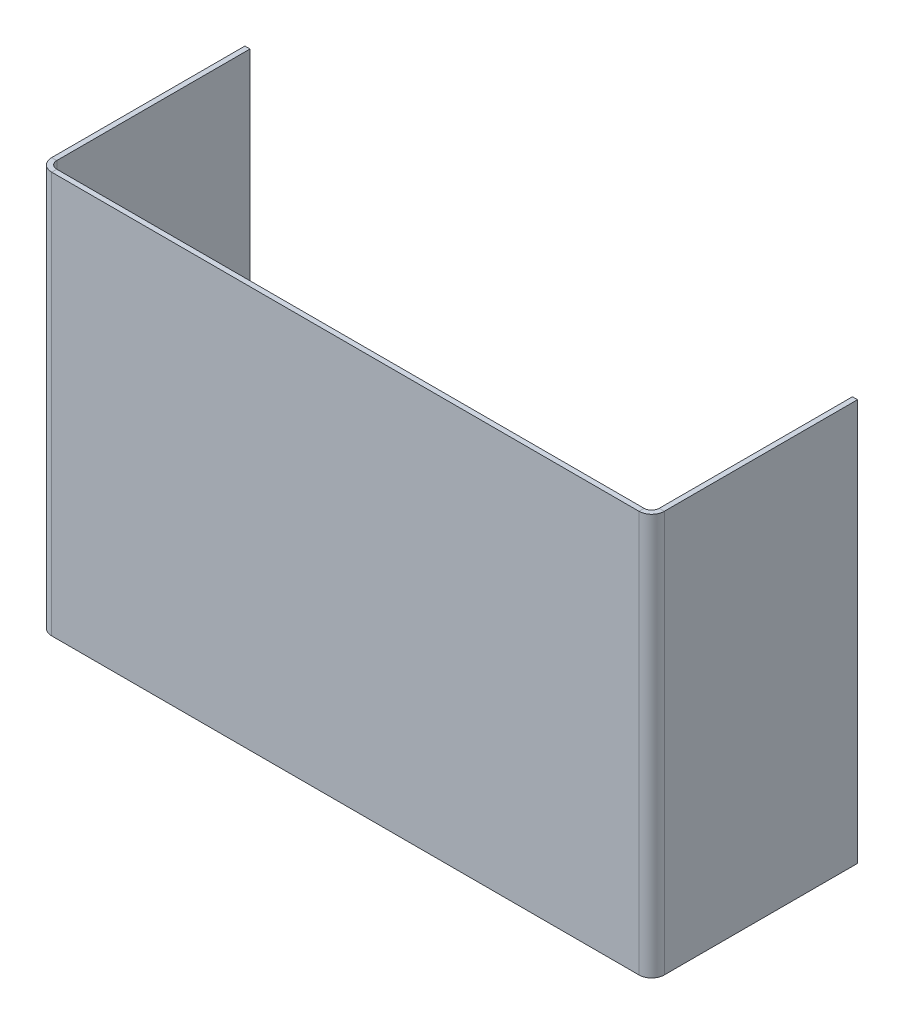
ISO-10303-21;
HEADER;
FILE_DESCRIPTION(('STEP AP214'),'2;1');
FILE_NAME('part.step','',(''),(''),'','','');
FILE_SCHEMA(('AUTOMOTIVE_DESIGN { 1 0 10303 214 1 1 1 1 }'));
ENDSEC;
DATA;
#1=APPLICATION_CONTEXT('core data for automotive mechanical design processes');
#2=APPLICATION_PROTOCOL_DEFINITION('international standard','automotive_design',2000,#1);
#3=PRODUCT_CONTEXT('',#1,'mechanical');
#4=PRODUCT('Part','Part','',(#3));
#5=PRODUCT_RELATED_PRODUCT_CATEGORY('part','',(#4));
#6=PRODUCT_DEFINITION_FORMATION('','',#4);
#7=PRODUCT_DEFINITION_CONTEXT('part definition',#1,'design');
#8=PRODUCT_DEFINITION('design','',#6,#7);
#9=PRODUCT_DEFINITION_SHAPE('','',#8);
#10=(LENGTH_UNIT() NAMED_UNIT(*) SI_UNIT(.MILLI.,.METRE.));
#11=(NAMED_UNIT(*) PLANE_ANGLE_UNIT() SI_UNIT($,.RADIAN.));
#12=(NAMED_UNIT(*) SI_UNIT($,.STERADIAN.) SOLID_ANGLE_UNIT());
#13=UNCERTAINTY_MEASURE_WITH_UNIT(LENGTH_MEASURE(1.E-05),#10,'distance_accuracy_value','');
#14=(GEOMETRIC_REPRESENTATION_CONTEXT(3) GLOBAL_UNCERTAINTY_ASSIGNED_CONTEXT((#13)) GLOBAL_UNIT_ASSIGNED_CONTEXT((#10,
#11,#12)) REPRESENTATION_CONTEXT('',''));
#15=CARTESIAN_POINT('',(0.,0.,0.));
#16=DIRECTION('',(0.,0.,1.));
#17=DIRECTION('',(1.,0.,0.));
#18=AXIS2_PLACEMENT_3D('',#15,#16,#17);
#19=CARTESIAN_POINT('',(0.,0.,-1.29032));
#20=DIRECTION('',(0.,0.,-1.));
#21=DIRECTION('',(-1.,0.,0.));
#22=AXIS2_PLACEMENT_3D('',#19,#20,#21);
#23=PLANE('',#22);
#24=DIRECTION('',(-1.,0.,0.));
#25=VECTOR('',#24,1.);
#26=CARTESIAN_POINT('',(-76.2,50.8,-1.29032));
#27=LINE('',#26,#25);
#28=CARTESIAN_POINT('',(74.295,50.8,-1.29031999999999));
#29=VERTEX_POINT('',#28);
#30=CARTESIAN_POINT('',(-74.295,50.8,-1.29032));
#31=VERTEX_POINT('',#30);
#32=EDGE_CURVE('E46',#29,#31,#27,.T.);
#33=ORIENTED_EDGE('',*,*,#32,.F.);
#34=DIRECTION('',(0.,-1.,0.));
#35=VECTOR('',#34,1.);
#36=CARTESIAN_POINT('',(74.295,-50.8,-1.29031999999999));
#37=LINE('',#36,#35);
#38=CARTESIAN_POINT('',(74.295,-50.8,-1.29031999999999));
#39=VERTEX_POINT('',#38);
#40=EDGE_CURVE('E177',#39,#29,#37,.F.);
#41=ORIENTED_EDGE('',*,*,#40,.F.);
#42=DIRECTION('',(1.,0.,0.));
#43=VECTOR('',#42,1.);
#44=CARTESIAN_POINT('',(-76.2,-50.8,-1.29032));
#45=LINE('',#44,#43);
#46=CARTESIAN_POINT('',(-74.295,-50.8,-1.29032));
#47=VERTEX_POINT('',#46);
#48=EDGE_CURVE('E11',#47,#39,#45,.T.);
#49=ORIENTED_EDGE('',*,*,#48,.F.);
#50=DIRECTION('',(0.,1.,0.));
#51=VECTOR('',#50,1.);
#52=CARTESIAN_POINT('',(-74.295,50.8,-1.29031999999999));
#53=LINE('',#52,#51);
#54=EDGE_CURVE('E232',#31,#47,#53,.F.);
#55=ORIENTED_EDGE('',*,*,#54,.F.);
#56=EDGE_LOOP('',(#33,#41,#49,#55));
#57=FACE_BOUND('',#56,.T.);
#58=ADVANCED_FACE('F37',(#57),#23,.T.);
#59=CARTESIAN_POINT('',(0.,0.,0.));
#60=DIRECTION('',(0.,0.,-1.));
#61=DIRECTION('',(-1.,0.,0.));
#62=AXIS2_PLACEMENT_3D('',#59,#60,#61);
#63=PLANE('',#62);
#64=DIRECTION('',(0.,-1.,0.));
#65=VECTOR('',#64,1.);
#66=CARTESIAN_POINT('',(74.295,-50.8,0.));
#67=LINE('',#66,#65);
#68=CARTESIAN_POINT('',(74.295,-50.8,0.));
#69=VERTEX_POINT('',#68);
#70=CARTESIAN_POINT('',(74.295,50.8,0.));
#71=VERTEX_POINT('',#70);
#72=EDGE_CURVE('E165',#69,#71,#67,.F.);
#73=ORIENTED_EDGE('',*,*,#72,.T.);
#74=DIRECTION('',(-1.,0.,0.));
#75=VECTOR('',#74,1.);
#76=CARTESIAN_POINT('',(-76.2,50.8,0.));
#77=LINE('',#76,#75);
#78=CARTESIAN_POINT('',(-74.295,50.8,0.));
#79=VERTEX_POINT('',#78);
#80=EDGE_CURVE('E238',#71,#79,#77,.T.);
#81=ORIENTED_EDGE('',*,*,#80,.T.);
#82=DIRECTION('',(0.,1.,0.));
#83=VECTOR('',#82,1.);
#84=CARTESIAN_POINT('',(-74.295,50.8,0.));
#85=LINE('',#84,#83);
#86=CARTESIAN_POINT('',(-74.295,-50.8,0.));
#87=VERTEX_POINT('',#86);
#88=EDGE_CURVE('E220',#79,#87,#85,.F.);
#89=ORIENTED_EDGE('',*,*,#88,.T.);
#90=DIRECTION('',(1.,0.,0.));
#91=VECTOR('',#90,1.);
#92=CARTESIAN_POINT('',(-76.2,-50.8,0.));
#93=LINE('',#92,#91);
#94=EDGE_CURVE('E41',#87,#69,#93,.T.);
#95=ORIENTED_EDGE('',*,*,#94,.T.);
#96=EDGE_LOOP('',(#73,#81,#89,#95));
#97=FACE_BOUND('',#96,.T.);
#98=ADVANCED_FACE('F244',(#97),#63,.F.);
#99=CARTESIAN_POINT('',(-76.2,-50.8,-1.29032));
#100=DIRECTION('',(0.,-1.,0.));
#101=DIRECTION('',(0.,0.,-1.));
#102=AXIS2_PLACEMENT_3D('',#99,#100,#101);
#103=PLANE('',#102);
#104=ORIENTED_EDGE('',*,*,#48,.T.);
#105=DIRECTION('',(0.,0.,1.));
#106=VECTOR('',#105,1.);
#107=CARTESIAN_POINT('',(74.295,-50.8,-1.29031999999999));
#108=LINE('',#107,#106);
#109=EDGE_CURVE('E171',#39,#69,#108,.T.);
#110=ORIENTED_EDGE('',*,*,#109,.T.);
#111=ORIENTED_EDGE('',*,*,#94,.F.);
#112=DIRECTION('',(0.,0.,1.));
#113=VECTOR('',#112,1.);
#114=CARTESIAN_POINT('',(-74.295,-50.8,-1.29031999999999));
#115=LINE('',#114,#113);
#116=EDGE_CURVE('E60',#47,#87,#115,.T.);
#117=ORIENTED_EDGE('',*,*,#116,.F.);
#118=EDGE_LOOP('',(#104,#110,#111,#117));
#119=FACE_BOUND('',#118,.T.);
#120=ADVANCED_FACE('F247',(#119),#103,.T.);
#121=CARTESIAN_POINT('',(-76.2,50.8,-1.29032));
#122=DIRECTION('',(0.,1.,0.));
#123=DIRECTION('',(0.,0.,1.));
#124=AXIS2_PLACEMENT_3D('',#121,#122,#123);
#125=PLANE('',#124);
#126=DIRECTION('',(0.,0.,1.));
#127=VECTOR('',#126,1.);
#128=CARTESIAN_POINT('',(74.295,50.8,-1.29031999999999));
#129=LINE('',#128,#127);
#130=EDGE_CURVE('E182',#29,#71,#129,.T.);
#131=ORIENTED_EDGE('',*,*,#130,.F.);
#132=ORIENTED_EDGE('',*,*,#32,.T.);
#133=DIRECTION('',(0.,0.,1.));
#134=VECTOR('',#133,1.);
#135=CARTESIAN_POINT('',(-74.295,50.8,-1.29031999999999));
#136=LINE('',#135,#134);
#137=EDGE_CURVE('E226',#31,#79,#136,.T.);
#138=ORIENTED_EDGE('',*,*,#137,.T.);
#139=ORIENTED_EDGE('',*,*,#80,.F.);
#140=EDGE_LOOP('',(#131,#132,#138,#139));
#141=FACE_BOUND('',#140,.T.);
#142=ADVANCED_FACE('F39',(#141),#125,.T.);
#143=CARTESIAN_POINT('',(-74.295,-50.8,-3.19531999999999));
#144=DIRECTION('',(0.,-1.,0.));
#145=DIRECTION('',(0.,0.,-1.));
#146=AXIS2_PLACEMENT_3D('',#143,#144,#145);
#147=PLANE('',#146);
#148=DIRECTION('',(-1.,0.,0.));
#149=VECTOR('',#148,1.);
#150=CARTESIAN_POINT('',(-76.2,-50.8,-3.19531999999999));
#151=LINE('',#150,#149);
#152=CARTESIAN_POINT('',(-76.2,-50.8,-3.19531999999999));
#153=VERTEX_POINT('',#152);
#154=CARTESIAN_POINT('',(-77.49032,-50.8,-3.19531999999998));
#155=VERTEX_POINT('',#154);
#156=EDGE_CURVE('E185',#153,#155,#151,.T.);
#157=ORIENTED_EDGE('',*,*,#156,.F.);
#158=CARTESIAN_POINT('',(-74.295,-50.8,-3.19531999999999));
#159=DIRECTION('',(0.,1.,0.));
#160=DIRECTION('',(0.,0.,1.));
#161=AXIS2_PLACEMENT_3D('',#158,#159,#160);
#162=CIRCLE('',#161,1.905);
#163=EDGE_CURVE('E229',#47,#153,#162,.F.);
#164=ORIENTED_EDGE('',*,*,#163,.F.);
#165=ORIENTED_EDGE('',*,*,#116,.T.);
#166=CARTESIAN_POINT('',(-74.295,-50.8,-3.19531999999999));
#167=DIRECTION('',(0.,1.,0.));
#168=DIRECTION('',(0.,0.,1.));
#169=AXIS2_PLACEMENT_3D('',#166,#167,#168);
#170=CIRCLE('',#169,3.19532);
#171=EDGE_CURVE('E222',#87,#155,#170,.F.);
#172=ORIENTED_EDGE('',*,*,#171,.T.);
#173=EDGE_LOOP('',(#157,#164,#165,#172));
#174=FACE_BOUND('',#173,.T.);
#175=ADVANCED_FACE('F303',(#174),#147,.T.);
#176=CARTESIAN_POINT('',(-74.295,50.8,-3.19531999999999));
#177=DIRECTION('',(0.,-1.,0.));
#178=DIRECTION('',(0.,0.,-1.));
#179=AXIS2_PLACEMENT_3D('',#176,#177,#178);
#180=PLANE('',#179);
#181=CARTESIAN_POINT('',(-74.295,50.8,-3.19531999999999));
#182=DIRECTION('',(0.,1.,0.));
#183=DIRECTION('',(0.,0.,1.));
#184=AXIS2_PLACEMENT_3D('',#181,#182,#183);
#185=CIRCLE('',#184,1.905);
#186=CARTESIAN_POINT('',(-76.2,50.8,-3.19531999999999));
#187=VERTEX_POINT('',#186);
#188=EDGE_CURVE('E217',#187,#31,#185,.T.);
#189=ORIENTED_EDGE('',*,*,#188,.F.);
#190=DIRECTION('',(-1.,0.,0.));
#191=VECTOR('',#190,1.);
#192=CARTESIAN_POINT('',(-76.2,50.8,-3.19531999999999));
#193=LINE('',#192,#191);
#194=CARTESIAN_POINT('',(-77.49032,50.8,-3.19531999999998));
#195=VERTEX_POINT('',#194);
#196=EDGE_CURVE('E190',#187,#195,#193,.T.);
#197=ORIENTED_EDGE('',*,*,#196,.T.);
#198=CARTESIAN_POINT('',(-74.295,50.8,-3.19531999999999));
#199=DIRECTION('',(0.,1.,0.));
#200=DIRECTION('',(0.,0.,1.));
#201=AXIS2_PLACEMENT_3D('',#198,#199,#200);
#202=CIRCLE('',#201,3.19532);
#203=EDGE_CURVE('E223',#195,#79,#202,.T.);
#204=ORIENTED_EDGE('',*,*,#203,.T.);
#205=ORIENTED_EDGE('',*,*,#137,.F.);
#206=EDGE_LOOP('',(#189,#197,#204,#205));
#207=FACE_BOUND('',#206,.T.);
#208=ADVANCED_FACE('F278',(#207),#180,.F.);
#209=CARTESIAN_POINT('',(-74.295,50.8,-3.19531999999999));
#210=DIRECTION('',(0.,1.,0.));
#211=DIRECTION('',(-1.,0.,0.));
#212=AXIS2_PLACEMENT_3D('',#209,#210,#211);
#213=CYLINDRICAL_SURFACE('',#212,3.19532);
#214=ORIENTED_EDGE('',*,*,#88,.F.);
#215=ORIENTED_EDGE('',*,*,#203,.F.);
#216=DIRECTION('',(0.,1.,0.));
#217=VECTOR('',#216,1.);
#218=CARTESIAN_POINT('',(-77.49032,0.,-3.19531999999998));
#219=LINE('',#218,#217);
#220=EDGE_CURVE('E193',#155,#195,#219,.T.);
#221=ORIENTED_EDGE('',*,*,#220,.F.);
#222=ORIENTED_EDGE('',*,*,#171,.F.);
#223=EDGE_LOOP('',(#214,#215,#221,#222));
#224=FACE_BOUND('',#223,.T.);
#225=ADVANCED_FACE('F301',(#224),#213,.T.);
#226=CARTESIAN_POINT('',(-74.295,50.8,-3.19531999999999));
#227=DIRECTION('',(0.,1.,0.));
#228=DIRECTION('',(-1.,0.,0.));
#229=AXIS2_PLACEMENT_3D('',#226,#227,#228);
#230=CYLINDRICAL_SURFACE('',#229,1.905);
#231=ORIENTED_EDGE('',*,*,#54,.T.);
#232=ORIENTED_EDGE('',*,*,#163,.T.);
#233=DIRECTION('',(0.,1.,0.));
#234=VECTOR('',#233,1.);
#235=CARTESIAN_POINT('',(-76.2,-50.8,-3.19531999999999));
#236=LINE('',#235,#234);
#237=EDGE_CURVE('E188',#153,#187,#236,.T.);
#238=ORIENTED_EDGE('',*,*,#237,.T.);
#239=ORIENTED_EDGE('',*,*,#188,.T.);
#240=EDGE_LOOP('',(#231,#232,#238,#239));
#241=FACE_BOUND('',#240,.T.);
#242=ADVANCED_FACE('F279',(#241),#230,.F.);
#243=CARTESIAN_POINT('',(-77.49032,50.8,-1.29032));
#244=DIRECTION('',(0.,1.,0.));
#245=DIRECTION('',(0.,0.,1.));
#246=AXIS2_PLACEMENT_3D('',#243,#244,#245);
#247=PLANE('',#246);
#248=DIRECTION('',(0.,0.,1.));
#249=VECTOR('',#248,1.);
#250=CARTESIAN_POINT('',(-77.49032,50.8,-1.29032));
#251=LINE('',#250,#249);
#252=CARTESIAN_POINT('',(-77.4903200000002,50.8,-52.09032));
#253=VERTEX_POINT('',#252);
#254=EDGE_CURVE('E205',#253,#195,#251,.T.);
#255=ORIENTED_EDGE('',*,*,#254,.T.);
#256=ORIENTED_EDGE('',*,*,#196,.F.);
#257=DIRECTION('',(0.,0.,1.));
#258=VECTOR('',#257,1.);
#259=CARTESIAN_POINT('',(-76.2,50.8,-1.29032));
#260=LINE('',#259,#258);
#261=CARTESIAN_POINT('',(-76.2000000000002,50.8,-52.09032));
#262=VERTEX_POINT('',#261);
#263=EDGE_CURVE('E202',#262,#187,#260,.T.);
#264=ORIENTED_EDGE('',*,*,#263,.F.);
#265=DIRECTION('',(1.,0.,0.));
#266=VECTOR('',#265,1.);
#267=CARTESIAN_POINT('',(-77.4903200000002,50.8,-52.09032));
#268=LINE('',#267,#266);
#269=EDGE_CURVE('E215',#253,#262,#268,.T.);
#270=ORIENTED_EDGE('',*,*,#269,.F.);
#271=EDGE_LOOP('',(#255,#256,#264,#270));
#272=FACE_BOUND('',#271,.T.);
#273=ADVANCED_FACE('F295',(#272),#247,.T.);
#274=CARTESIAN_POINT('',(-77.4903200000002,-50.8,-52.09032));
#275=DIRECTION('',(0.,-1.,0.));
#276=DIRECTION('',(0.,0.,-1.));
#277=AXIS2_PLACEMENT_3D('',#274,#275,#276);
#278=PLANE('',#277);
#279=DIRECTION('',(0.,0.,-1.));
#280=VECTOR('',#279,1.);
#281=CARTESIAN_POINT('',(-76.2000000000002,-50.8,-52.09032));
#282=LINE('',#281,#280);
#283=CARTESIAN_POINT('',(-76.2000000000002,-50.8,-52.09032));
#284=VERTEX_POINT('',#283);
#285=EDGE_CURVE('E198',#153,#284,#282,.T.);
#286=ORIENTED_EDGE('',*,*,#285,.F.);
#287=ORIENTED_EDGE('',*,*,#156,.T.);
#288=DIRECTION('',(0.,0.,-1.));
#289=VECTOR('',#288,1.);
#290=CARTESIAN_POINT('',(-77.4903200000002,-50.8,-52.09032));
#291=LINE('',#290,#289);
#292=CARTESIAN_POINT('',(-77.4903200000002,-50.8,-52.09032));
#293=VERTEX_POINT('',#292);
#294=EDGE_CURVE('E199',#155,#293,#291,.T.);
#295=ORIENTED_EDGE('',*,*,#294,.T.);
#296=DIRECTION('',(1.,0.,0.));
#297=VECTOR('',#296,1.);
#298=CARTESIAN_POINT('',(-77.4903200000002,-50.8,-52.09032));
#299=LINE('',#298,#297);
#300=EDGE_CURVE('E208',#293,#284,#299,.T.);
#301=ORIENTED_EDGE('',*,*,#300,.T.);
#302=EDGE_LOOP('',(#286,#287,#295,#301));
#303=FACE_BOUND('',#302,.T.);
#304=ADVANCED_FACE('F287',(#303),#278,.T.);
#305=CARTESIAN_POINT('',(-77.49032,0.,2.75121990453518E-13));
#306=DIRECTION('',(-1.,0.,0.));
#307=DIRECTION('',(0.,0.,1.));
#308=AXIS2_PLACEMENT_3D('',#305,#306,#307);
#309=PLANE('',#308);
#310=ORIENTED_EDGE('',*,*,#294,.F.);
#311=ORIENTED_EDGE('',*,*,#220,.T.);
#312=ORIENTED_EDGE('',*,*,#254,.F.);
#313=DIRECTION('',(0.,1.,0.));
#314=VECTOR('',#313,1.);
#315=CARTESIAN_POINT('',(-77.4903200000002,50.8,-52.09032));
#316=LINE('',#315,#314);
#317=EDGE_CURVE('E201',#293,#253,#316,.T.);
#318=ORIENTED_EDGE('',*,*,#317,.F.);
#319=EDGE_LOOP('',(#310,#311,#312,#318));
#320=FACE_BOUND('',#319,.T.);
#321=ADVANCED_FACE('F298',(#320),#309,.T.);
#322=CARTESIAN_POINT('',(-76.2,0.,2.70616862252382E-13));
#323=DIRECTION('',(-1.,0.,0.));
#324=DIRECTION('',(0.,0.,1.));
#325=AXIS2_PLACEMENT_3D('',#322,#323,#324);
#326=PLANE('',#325);
#327=ORIENTED_EDGE('',*,*,#237,.F.);
#328=ORIENTED_EDGE('',*,*,#285,.T.);
#329=DIRECTION('',(0.,1.,0.));
#330=VECTOR('',#329,1.);
#331=CARTESIAN_POINT('',(-76.2000000000002,50.8,-52.09032));
#332=LINE('',#331,#330);
#333=EDGE_CURVE('E210',#284,#262,#332,.T.);
#334=ORIENTED_EDGE('',*,*,#333,.T.);
#335=ORIENTED_EDGE('',*,*,#263,.T.);
#336=EDGE_LOOP('',(#327,#328,#334,#335));
#337=FACE_BOUND('',#336,.T.);
#338=ADVANCED_FACE('F283',(#337),#326,.F.);
#339=CARTESIAN_POINT('',(-77.4903200000002,50.8,-52.09032));
#340=DIRECTION('',(0.,0.,-1.));
#341=DIRECTION('',(-1.,0.,0.));
#342=AXIS2_PLACEMENT_3D('',#339,#340,#341);
#343=PLANE('',#342);
#344=ORIENTED_EDGE('',*,*,#333,.F.);
#345=ORIENTED_EDGE('',*,*,#300,.F.);
#346=ORIENTED_EDGE('',*,*,#317,.T.);
#347=ORIENTED_EDGE('',*,*,#269,.T.);
#348=EDGE_LOOP('',(#344,#345,#346,#347));
#349=FACE_BOUND('',#348,.T.);
#350=ADVANCED_FACE('F293',(#349),#343,.T.);
#351=CARTESIAN_POINT('',(74.295,50.8,-3.19531999999999));
#352=DIRECTION('',(0.,1.,0.));
#353=DIRECTION('',(0.,0.,1.));
#354=AXIS2_PLACEMENT_3D('',#351,#352,#353);
#355=PLANE('',#354);
#356=DIRECTION('',(1.,0.,0.));
#357=VECTOR('',#356,1.);
#358=CARTESIAN_POINT('',(76.2,50.8,-3.19531999999999));
#359=LINE('',#358,#357);
#360=CARTESIAN_POINT('',(76.2,50.8,-3.19531999999999));
#361=VERTEX_POINT('',#360);
#362=CARTESIAN_POINT('',(77.49032,50.8,-3.19531999999998));
#363=VERTEX_POINT('',#362);
#364=EDGE_CURVE('E135',#361,#363,#359,.T.);
#365=ORIENTED_EDGE('',*,*,#364,.F.);
#366=CARTESIAN_POINT('',(74.295,50.8,-3.19531999999999));
#367=DIRECTION('',(0.,-1.,0.));
#368=DIRECTION('',(0.,0.,-1.));
#369=AXIS2_PLACEMENT_3D('',#366,#367,#368);
#370=CIRCLE('',#369,1.905);
#371=EDGE_CURVE('E174',#29,#361,#370,.F.);
#372=ORIENTED_EDGE('',*,*,#371,.F.);
#373=ORIENTED_EDGE('',*,*,#130,.T.);
#374=CARTESIAN_POINT('',(74.295,50.8,-3.19531999999999));
#375=DIRECTION('',(0.,-1.,0.));
#376=DIRECTION('',(0.,0.,-1.));
#377=AXIS2_PLACEMENT_3D('',#374,#375,#376);
#378=CIRCLE('',#377,3.19532);
#379=EDGE_CURVE('E167',#71,#363,#378,.F.);
#380=ORIENTED_EDGE('',*,*,#379,.T.);
#381=EDGE_LOOP('',(#365,#372,#373,#380));
#382=FACE_BOUND('',#381,.T.);
#383=ADVANCED_FACE('F271',(#382),#355,.T.);
#384=CARTESIAN_POINT('',(74.295,-50.8,-3.19531999999999));
#385=DIRECTION('',(0.,1.,0.));
#386=DIRECTION('',(0.,0.,1.));
#387=AXIS2_PLACEMENT_3D('',#384,#385,#386);
#388=PLANE('',#387);
#389=CARTESIAN_POINT('',(74.295,-50.8,-3.19531999999999));
#390=DIRECTION('',(0.,-1.,0.));
#391=DIRECTION('',(0.,0.,-1.));
#392=AXIS2_PLACEMENT_3D('',#389,#390,#391);
#393=CIRCLE('',#392,1.905);
#394=CARTESIAN_POINT('',(76.2,-50.8,-3.19531999999999));
#395=VERTEX_POINT('',#394);
#396=EDGE_CURVE('E163',#395,#39,#393,.T.);
#397=ORIENTED_EDGE('',*,*,#396,.F.);
#398=DIRECTION('',(1.,0.,0.));
#399=VECTOR('',#398,1.);
#400=CARTESIAN_POINT('',(76.2,-50.8,-3.19531999999999));
#401=LINE('',#400,#399);
#402=CARTESIAN_POINT('',(77.49032,-50.8,-3.19531999999998));
#403=VERTEX_POINT('',#402);
#404=EDGE_CURVE('E256',#395,#403,#401,.T.);
#405=ORIENTED_EDGE('',*,*,#404,.T.);
#406=CARTESIAN_POINT('',(74.295,-50.8,-3.19531999999999));
#407=DIRECTION('',(0.,-1.,0.));
#408=DIRECTION('',(0.,0.,-1.));
#409=AXIS2_PLACEMENT_3D('',#406,#407,#408);
#410=CIRCLE('',#409,3.19532);
#411=EDGE_CURVE('E168',#403,#69,#410,.T.);
#412=ORIENTED_EDGE('',*,*,#411,.T.);
#413=ORIENTED_EDGE('',*,*,#109,.F.);
#414=EDGE_LOOP('',(#397,#405,#412,#413));
#415=FACE_BOUND('',#414,.T.);
#416=ADVANCED_FACE('F254',(#415),#388,.F.);
#417=CARTESIAN_POINT('',(74.295,-50.8,-3.19531999999999));
#418=DIRECTION('',(0.,-1.,0.));
#419=DIRECTION('',(1.,0.,0.));
#420=AXIS2_PLACEMENT_3D('',#417,#418,#419);
#421=CYLINDRICAL_SURFACE('',#420,3.19532);
#422=ORIENTED_EDGE('',*,*,#72,.F.);
#423=ORIENTED_EDGE('',*,*,#411,.F.);
#424=DIRECTION('',(0.,-1.,0.));
#425=VECTOR('',#424,1.);
#426=CARTESIAN_POINT('',(77.49032,0.,-3.19531999999998));
#427=LINE('',#426,#425);
#428=EDGE_CURVE('E159',#363,#403,#427,.T.);
#429=ORIENTED_EDGE('',*,*,#428,.F.);
#430=ORIENTED_EDGE('',*,*,#379,.F.);
#431=EDGE_LOOP('',(#422,#423,#429,#430));
#432=FACE_BOUND('',#431,.T.);
#433=ADVANCED_FACE('F252',(#432),#421,.T.);
#434=CARTESIAN_POINT('',(74.295,-50.8,-3.19531999999999));
#435=DIRECTION('',(0.,-1.,0.));
#436=DIRECTION('',(1.,0.,0.));
#437=AXIS2_PLACEMENT_3D('',#434,#435,#436);
#438=CYLINDRICAL_SURFACE('',#437,1.905);
#439=ORIENTED_EDGE('',*,*,#40,.T.);
#440=ORIENTED_EDGE('',*,*,#371,.T.);
#441=DIRECTION('',(0.,-1.,0.));
#442=VECTOR('',#441,1.);
#443=CARTESIAN_POINT('',(76.2,50.8,-3.19531999999999));
#444=LINE('',#443,#442);
#445=EDGE_CURVE('E259',#361,#395,#444,.T.);
#446=ORIENTED_EDGE('',*,*,#445,.T.);
#447=ORIENTED_EDGE('',*,*,#396,.T.);
#448=EDGE_LOOP('',(#439,#440,#446,#447));
#449=FACE_BOUND('',#448,.T.);
#450=ADVANCED_FACE('F268',(#449),#438,.F.);
#451=CARTESIAN_POINT('',(77.49032,-50.8,-1.29032));
#452=DIRECTION('',(0.,-1.,0.));
#453=DIRECTION('',(0.,0.,-1.));
#454=AXIS2_PLACEMENT_3D('',#451,#452,#453);
#455=PLANE('',#454);
#456=DIRECTION('',(0.,0.,1.));
#457=VECTOR('',#456,1.);
#458=CARTESIAN_POINT('',(77.49032,-50.8,-1.29032));
#459=LINE('',#458,#457);
#460=CARTESIAN_POINT('',(77.4903200000002,-50.8,-52.09032));
#461=VERTEX_POINT('',#460);
#462=EDGE_CURVE('E149',#461,#403,#459,.T.);
#463=ORIENTED_EDGE('',*,*,#462,.T.);
#464=ORIENTED_EDGE('',*,*,#404,.F.);
#465=DIRECTION('',(0.,0.,1.));
#466=VECTOR('',#465,1.);
#467=CARTESIAN_POINT('',(76.2,-50.8,-1.29032));
#468=LINE('',#467,#466);
#469=CARTESIAN_POINT('',(76.2000000000002,-50.8,-52.09032));
#470=VERTEX_POINT('',#469);
#471=EDGE_CURVE('E140',#470,#395,#468,.T.);
#472=ORIENTED_EDGE('',*,*,#471,.F.);
#473=DIRECTION('',(-1.,0.,0.));
#474=VECTOR('',#473,1.);
#475=CARTESIAN_POINT('',(77.4903200000002,-50.8,-52.09032));
#476=LINE('',#475,#474);
#477=EDGE_CURVE('E148',#461,#470,#476,.T.);
#478=ORIENTED_EDGE('',*,*,#477,.F.);
#479=EDGE_LOOP('',(#463,#464,#472,#478));
#480=FACE_BOUND('',#479,.T.);
#481=ADVANCED_FACE('F261',(#480),#455,.T.);
#482=CARTESIAN_POINT('',(77.4903200000002,50.8,-52.09032));
#483=DIRECTION('',(0.,1.,0.));
#484=DIRECTION('',(0.,0.,1.));
#485=AXIS2_PLACEMENT_3D('',#482,#483,#484);
#486=PLANE('',#485);
#487=DIRECTION('',(0.,0.,-1.));
#488=VECTOR('',#487,1.);
#489=CARTESIAN_POINT('',(76.2000000000002,50.8,-52.09032));
#490=LINE('',#489,#488);
#491=CARTESIAN_POINT('',(76.2000000000002,50.8,-52.09032));
#492=VERTEX_POINT('',#491);
#493=EDGE_CURVE('E157',#361,#492,#490,.T.);
#494=ORIENTED_EDGE('',*,*,#493,.F.);
#495=ORIENTED_EDGE('',*,*,#364,.T.);
#496=DIRECTION('',(0.,0.,-1.));
#497=VECTOR('',#496,1.);
#498=CARTESIAN_POINT('',(77.4903200000002,50.8,-52.09032));
#499=LINE('',#498,#497);
#500=CARTESIAN_POINT('',(77.4903200000002,50.8,-52.09032));
#501=VERTEX_POINT('',#500);
#502=EDGE_CURVE('E129',#363,#501,#499,.T.);
#503=ORIENTED_EDGE('',*,*,#502,.T.);
#504=DIRECTION('',(-1.,0.,0.));
#505=VECTOR('',#504,1.);
#506=CARTESIAN_POINT('',(77.4903200000002,50.8,-52.09032));
#507=LINE('',#506,#505);
#508=EDGE_CURVE('E133',#501,#492,#507,.T.);
#509=ORIENTED_EDGE('',*,*,#508,.T.);
#510=EDGE_LOOP('',(#494,#495,#503,#509));
#511=FACE_BOUND('',#510,.T.);
#512=ADVANCED_FACE('F132',(#511),#486,.T.);
#513=CARTESIAN_POINT('',(77.49032,0.,2.75121990453518E-13));
#514=DIRECTION('',(1.,0.,0.));
#515=DIRECTION('',(0.,0.,-1.));
#516=AXIS2_PLACEMENT_3D('',#513,#514,#515);
#517=PLANE('',#516);
#518=ORIENTED_EDGE('',*,*,#502,.F.);
#519=ORIENTED_EDGE('',*,*,#428,.T.);
#520=ORIENTED_EDGE('',*,*,#462,.F.);
#521=DIRECTION('',(0.,-1.,0.));
#522=VECTOR('',#521,1.);
#523=CARTESIAN_POINT('',(77.4903200000002,-50.8,-52.09032));
#524=LINE('',#523,#522);
#525=EDGE_CURVE('E139',#501,#461,#524,.T.);
#526=ORIENTED_EDGE('',*,*,#525,.F.);
#527=EDGE_LOOP('',(#518,#519,#520,#526));
#528=FACE_BOUND('',#527,.T.);
#529=ADVANCED_FACE('F151',(#528),#517,.T.);
#530=CARTESIAN_POINT('',(76.2,0.,2.70616862252382E-13));
#531=DIRECTION('',(1.,0.,0.));
#532=DIRECTION('',(0.,0.,-1.));
#533=AXIS2_PLACEMENT_3D('',#530,#531,#532);
#534=PLANE('',#533);
#535=ORIENTED_EDGE('',*,*,#445,.F.);
#536=ORIENTED_EDGE('',*,*,#493,.T.);
#537=DIRECTION('',(0.,-1.,0.));
#538=VECTOR('',#537,1.);
#539=CARTESIAN_POINT('',(76.2000000000002,-50.8,-52.09032));
#540=LINE('',#539,#538);
#541=EDGE_CURVE('E147',#492,#470,#540,.T.);
#542=ORIENTED_EDGE('',*,*,#541,.T.);
#543=ORIENTED_EDGE('',*,*,#471,.T.);
#544=EDGE_LOOP('',(#535,#536,#542,#543));
#545=FACE_BOUND('',#544,.T.);
#546=ADVANCED_FACE('F264',(#545),#534,.F.);
#547=CARTESIAN_POINT('',(77.4903200000002,-50.8,-52.09032));
#548=DIRECTION('',(0.,0.,-1.));
#549=DIRECTION('',(-1.,0.,0.));
#550=AXIS2_PLACEMENT_3D('',#547,#548,#549);
#551=PLANE('',#550);
#552=ORIENTED_EDGE('',*,*,#541,.F.);
#553=ORIENTED_EDGE('',*,*,#508,.F.);
#554=ORIENTED_EDGE('',*,*,#525,.T.);
#555=ORIENTED_EDGE('',*,*,#477,.T.);
#556=EDGE_LOOP('',(#552,#553,#554,#555));
#557=FACE_BOUND('',#556,.T.);
#558=ADVANCED_FACE('F144',(#557),#551,.T.);
#559=CLOSED_SHELL('',(#58,#98,#120,#142,#175,#208,#225,#242,#273,#304,#321,#338,#350,#383,#416,
#433,#450,#481,#512,#529,#546,#558));
#560=MANIFOLD_SOLID_BREP('B2',#559);
#561=ADVANCED_BREP_SHAPE_REPRESENTATION('',(#18,#560),#14);
#562=SHAPE_DEFINITION_REPRESENTATION(#9,#561);
ENDSEC;
END-ISO-10303-21;
